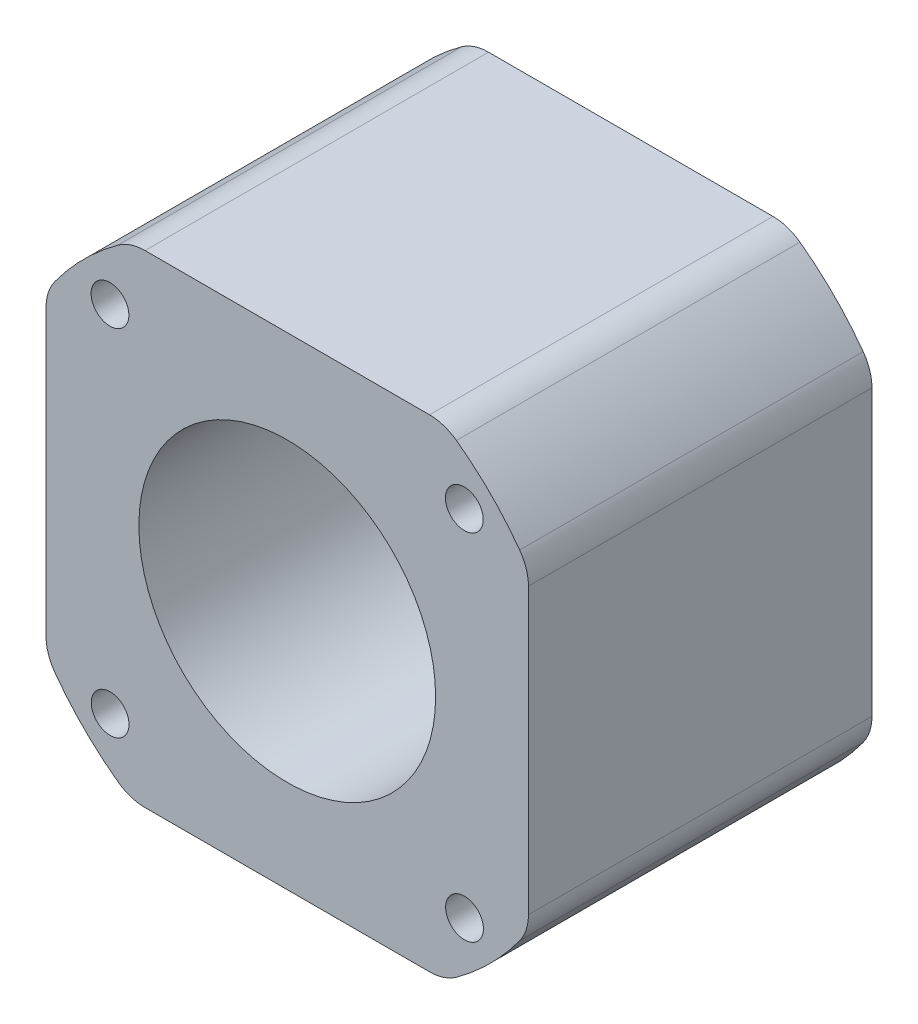
ISO-10303-21;
HEADER;
FILE_DESCRIPTION(('STEP AP214'),'2;1');
FILE_NAME('part.step','',(''),(''),'','','');
FILE_SCHEMA(('AUTOMOTIVE_DESIGN { 1 0 10303 214 1 1 1 1 }'));
ENDSEC;
DATA;
#1=APPLICATION_CONTEXT('core data for automotive mechanical design processes');
#2=APPLICATION_PROTOCOL_DEFINITION('international standard','automotive_design',2000,#1);
#3=PRODUCT_CONTEXT('',#1,'mechanical');
#4=PRODUCT('Part','Part','',(#3));
#5=PRODUCT_RELATED_PRODUCT_CATEGORY('part','',(#4));
#6=PRODUCT_DEFINITION_FORMATION('','',#4);
#7=PRODUCT_DEFINITION_CONTEXT('part definition',#1,'design');
#8=PRODUCT_DEFINITION('design','',#6,#7);
#9=PRODUCT_DEFINITION_SHAPE('','',#8);
#10=(LENGTH_UNIT() NAMED_UNIT(*) SI_UNIT(.MILLI.,.METRE.));
#11=(NAMED_UNIT(*) PLANE_ANGLE_UNIT() SI_UNIT($,.RADIAN.));
#12=(NAMED_UNIT(*) SI_UNIT($,.STERADIAN.) SOLID_ANGLE_UNIT());
#13=UNCERTAINTY_MEASURE_WITH_UNIT(LENGTH_MEASURE(1.E-05),#10,'distance_accuracy_value','');
#14=(GEOMETRIC_REPRESENTATION_CONTEXT(3) GLOBAL_UNCERTAINTY_ASSIGNED_CONTEXT((#13)) GLOBAL_UNIT_ASSIGNED_CONTEXT((#10,
#11,#12)) REPRESENTATION_CONTEXT('',''));
#15=CARTESIAN_POINT('',(0.,0.,0.));
#16=DIRECTION('',(0.,0.,1.));
#17=DIRECTION('',(1.,0.,0.));
#18=AXIS2_PLACEMENT_3D('',#15,#16,#17);
#19=CARTESIAN_POINT('',(-70.0852044065147,12.5160385326488,19.8188525116293));
#20=DIRECTION('',(0.,0.,1.));
#21=DIRECTION('',(1.,0.,0.));
#22=AXIS2_PLACEMENT_3D('',#19,#20,#21);
#23=CYLINDRICAL_SURFACE('',#22,1.65);
#24=CARTESIAN_POINT('',(-70.0852044065147,12.5160385326488,19.8188525116293));
#25=DIRECTION('',(0.,0.,-1.));
#26=DIRECTION('',(1.,0.,0.));
#27=AXIS2_PLACEMENT_3D('',#24,#25,#26);
#28=CIRCLE('',#27,1.65);
#29=CARTESIAN_POINT('',(-71.7352044065147,12.5160385326488,19.8188525116293));
#30=VERTEX_POINT('',#29);
#31=EDGE_CURVE('E11',#30,#30,#28,.T.);
#32=ORIENTED_EDGE('',*,*,#31,.T.);
#33=EDGE_LOOP('',(#32));
#34=FACE_BOUND('',#33,.T.);
#35=CARTESIAN_POINT('',(-70.0852044065147,12.5160385326488,49.8188525116293));
#36=DIRECTION('',(0.,0.,1.));
#37=DIRECTION('',(1.,0.,0.));
#38=AXIS2_PLACEMENT_3D('',#35,#36,#37);
#39=CIRCLE('',#38,1.65);
#40=CARTESIAN_POINT('',(-68.4352044065147,12.5160385326488,49.8188525116293));
#41=VERTEX_POINT('',#40);
#42=EDGE_CURVE('E27',#41,#41,#39,.T.);
#43=ORIENTED_EDGE('',*,*,#42,.T.);
#44=EDGE_LOOP('',(#43));
#45=FACE_BOUND('',#44,.T.);
#46=ADVANCED_FACE('F17',(#34,#45),#23,.F.);
#47=CARTESIAN_POINT('',(-54.6053184065147,-2.95027046735118,19.8188525116293));
#48=DIRECTION('',(0.,0.,1.));
#49=DIRECTION('',(1.,0.,0.));
#50=AXIS2_PLACEMENT_3D('',#47,#48,#49);
#51=CYLINDRICAL_SURFACE('',#50,12.9575);
#52=CARTESIAN_POINT('',(-54.6053184065147,-2.95027046735118,19.8188525116293));
#53=DIRECTION('',(0.,0.,-1.));
#54=DIRECTION('',(1.,0.,0.));
#55=AXIS2_PLACEMENT_3D('',#52,#53,#54);
#56=CIRCLE('',#55,12.9575);
#57=CARTESIAN_POINT('',(-67.5628184065147,-2.95027046735118,19.8188525116293));
#58=VERTEX_POINT('',#57);
#59=EDGE_CURVE('E202',#58,#58,#56,.T.);
#60=ORIENTED_EDGE('',*,*,#59,.T.);
#61=EDGE_LOOP('',(#60));
#62=FACE_BOUND('',#61,.T.);
#63=CARTESIAN_POINT('',(-54.6053184065147,-2.95027046735118,49.8188525116293));
#64=DIRECTION('',(0.,0.,-1.));
#65=DIRECTION('',(1.,0.,0.));
#66=AXIS2_PLACEMENT_3D('',#63,#64,#65);
#67=CIRCLE('',#66,12.9575);
#68=CARTESIAN_POINT('',(-41.6478184065147,-2.95027046735118,49.8188525116293));
#69=VERTEX_POINT('',#68);
#70=EDGE_CURVE('E166',#69,#69,#67,.T.);
#71=ORIENTED_EDGE('',*,*,#70,.F.);
#72=EDGE_LOOP('',(#71));
#73=FACE_BOUND('',#72,.T.);
#74=ADVANCED_FACE('F718',(#62,#73),#51,.F.);
#75=CARTESIAN_POINT('',(-39.1254324065147,-18.4165794673512,19.8188525116293));
#76=DIRECTION('',(0.,0.,1.));
#77=DIRECTION('',(1.,0.,0.));
#78=AXIS2_PLACEMENT_3D('',#75,#76,#77);
#79=CYLINDRICAL_SURFACE('',#78,1.65);
#80=CARTESIAN_POINT('',(-39.1254324065147,-18.4165794673512,19.8188525116293));
#81=DIRECTION('',(0.,0.,-1.));
#82=DIRECTION('',(1.,0.,0.));
#83=AXIS2_PLACEMENT_3D('',#80,#81,#82);
#84=CIRCLE('',#83,1.65);
#85=CARTESIAN_POINT('',(-40.7754324065147,-18.4165794673512,19.8188525116293));
#86=VERTEX_POINT('',#85);
#87=EDGE_CURVE('E205',#86,#86,#84,.T.);
#88=ORIENTED_EDGE('',*,*,#87,.T.);
#89=EDGE_LOOP('',(#88));
#90=FACE_BOUND('',#89,.T.);
#91=CARTESIAN_POINT('',(-39.1254324065147,-18.4165794673512,49.8188525116293));
#92=DIRECTION('',(0.,0.,-1.));
#93=DIRECTION('',(1.,0.,0.));
#94=AXIS2_PLACEMENT_3D('',#91,#92,#93);
#95=CIRCLE('',#94,1.65);
#96=CARTESIAN_POINT('',(-37.4754324065147,-18.4165794673512,49.8188525116293));
#97=VERTEX_POINT('',#96);
#98=EDGE_CURVE('E157',#97,#97,#95,.T.);
#99=ORIENTED_EDGE('',*,*,#98,.F.);
#100=EDGE_LOOP('',(#99));
#101=FACE_BOUND('',#100,.T.);
#102=ADVANCED_FACE('F722',(#90,#101),#79,.F.);
#103=CARTESIAN_POINT('',(-70.0716274065147,-18.4301564673512,19.8188525116293));
#104=DIRECTION('',(0.,0.,1.));
#105=DIRECTION('',(1.,0.,0.));
#106=AXIS2_PLACEMENT_3D('',#103,#104,#105);
#107=CYLINDRICAL_SURFACE('',#106,1.65);
#108=CARTESIAN_POINT('',(-70.0716274065147,-18.4301564673512,19.8188525116293));
#109=DIRECTION('',(0.,0.,-1.));
#110=DIRECTION('',(1.,0.,0.));
#111=AXIS2_PLACEMENT_3D('',#108,#109,#110);
#112=CIRCLE('',#111,1.65);
#113=CARTESIAN_POINT('',(-71.7216274065147,-18.4301564673512,19.8188525116293));
#114=VERTEX_POINT('',#113);
#115=EDGE_CURVE('E213',#114,#114,#112,.T.);
#116=ORIENTED_EDGE('',*,*,#115,.T.);
#117=EDGE_LOOP('',(#116));
#118=FACE_BOUND('',#117,.T.);
#119=CARTESIAN_POINT('',(-70.0716274065147,-18.4301564673512,49.8188525116293));
#120=DIRECTION('',(0.,0.,-1.));
#121=DIRECTION('',(1.,0.,0.));
#122=AXIS2_PLACEMENT_3D('',#119,#120,#121);
#123=CIRCLE('',#122,1.65);
#124=CARTESIAN_POINT('',(-68.4216274065147,-18.4301564673512,49.8188525116293));
#125=VERTEX_POINT('',#124);
#126=EDGE_CURVE('E153',#125,#125,#123,.T.);
#127=ORIENTED_EDGE('',*,*,#126,.F.);
#128=EDGE_LOOP('',(#127));
#129=FACE_BOUND('',#128,.T.);
#130=ADVANCED_FACE('F154',(#118,#129),#107,.F.);
#131=CARTESIAN_POINT('',(-39.1390094065147,12.5296155326488,19.8188525116293));
#132=DIRECTION('',(0.,0.,1.));
#133=DIRECTION('',(1.,0.,0.));
#134=AXIS2_PLACEMENT_3D('',#131,#132,#133);
#135=CYLINDRICAL_SURFACE('',#134,1.65);
#136=CARTESIAN_POINT('',(-39.1390094065147,12.5296155326488,19.8188525116293));
#137=DIRECTION('',(0.,0.,-1.));
#138=DIRECTION('',(1.,0.,0.));
#139=AXIS2_PLACEMENT_3D('',#136,#137,#138);
#140=CIRCLE('',#139,1.65);
#141=CARTESIAN_POINT('',(-40.7890094065147,12.5296155326488,19.8188525116293));
#142=VERTEX_POINT('',#141);
#143=EDGE_CURVE('E221',#142,#142,#140,.T.);
#144=ORIENTED_EDGE('',*,*,#143,.T.);
#145=EDGE_LOOP('',(#144));
#146=FACE_BOUND('',#145,.T.);
#147=CARTESIAN_POINT('',(-39.1390094065147,12.5296155326488,49.8188525116293));
#148=DIRECTION('',(0.,0.,-1.));
#149=DIRECTION('',(1.,0.,0.));
#150=AXIS2_PLACEMENT_3D('',#147,#148,#149);
#151=CIRCLE('',#150,1.65);
#152=CARTESIAN_POINT('',(-37.4890094065147,12.5296155326488,49.8188525116293));
#153=VERTEX_POINT('',#152);
#154=EDGE_CURVE('E158',#153,#153,#151,.T.);
#155=ORIENTED_EDGE('',*,*,#154,.F.);
#156=EDGE_LOOP('',(#155));
#157=FACE_BOUND('',#156,.T.);
#158=ADVANCED_FACE('F699',(#146,#157),#135,.F.);
#159=CARTESIAN_POINT('',(-67.0275698635147,14.1147295326488,49.8188525116293));
#160=DIRECTION('',(0.,0.,-1.));
#161=DIRECTION('',(0.,1.,0.));
#162=AXIS2_PLACEMENT_3D('',#159,#160,#161);
#163=CYLINDRICAL_SURFACE('',#162,4.);
#164=DIRECTION('',(0.,0.,1.));
#165=VECTOR('',#164,1.);
#166=CARTESIAN_POINT('',(-69.3816622952109,17.3486511181171,34.8188525116293));
#167=LINE('',#166,#165);
#168=CARTESIAN_POINT('',(-69.3816622909978,17.348651121184,19.8188525116293));
#169=VERTEX_POINT('',#168);
#170=CARTESIAN_POINT('',(-69.381662291074,17.3486511212887,49.8188525116293));
#171=VERTEX_POINT('',#170);
#172=EDGE_CURVE('E262',#169,#171,#167,.T.);
#173=ORIENTED_EDGE('',*,*,#172,.T.);
#174=CARTESIAN_POINT('',(-67.0275698635147,14.1147295326488,49.8188525116293));
#175=DIRECTION('',(0.,0.,1.));
#176=DIRECTION('',(0.,1.,0.));
#177=AXIS2_PLACEMENT_3D('',#174,#175,#176);
#178=CIRCLE('',#177,4.);
#179=CARTESIAN_POINT('',(-67.0275698635147,18.1147295326488,49.8188525116293));
#180=VERTEX_POINT('',#179);
#181=EDGE_CURVE('E284',#180,#171,#178,.T.);
#182=ORIENTED_EDGE('',*,*,#181,.F.);
#183=DIRECTION('',(0.,0.,-1.));
#184=VECTOR('',#183,1.);
#185=CARTESIAN_POINT('',(-67.0275698635147,18.1147295326488,34.8188525116293));
#186=LINE('',#185,#184);
#187=CARTESIAN_POINT('',(-67.0275698635147,18.1147295326488,19.8188525116293));
#188=VERTEX_POINT('',#187);
#189=EDGE_CURVE('E258',#180,#188,#186,.T.);
#190=ORIENTED_EDGE('',*,*,#189,.T.);
#191=CARTESIAN_POINT('',(-67.0275698635147,14.1147295326488,19.8188525116293));
#192=DIRECTION('',(0.,0.,1.));
#193=DIRECTION('',(0.,1.,0.));
#194=AXIS2_PLACEMENT_3D('',#191,#192,#193);
#195=CIRCLE('',#194,4.);
#196=EDGE_CURVE('E196',#188,#169,#195,.T.);
#197=ORIENTED_EDGE('',*,*,#196,.T.);
#198=EDGE_LOOP('',(#173,#182,#190,#197));
#199=FACE_BOUND('',#198,.T.);
#200=ADVANCED_FACE('F693',(#199),#163,.T.);
#201=CARTESIAN_POINT('',(-54.6053184065147,-2.95027046735118,49.8188525116293));
#202=DIRECTION('',(0.,0.,-1.));
#203=DIRECTION('',(0.,1.,0.));
#204=AXIS2_PLACEMENT_3D('',#201,#202,#203);
#205=CYLINDRICAL_SURFACE('',#204,25.1075);
#206=DIRECTION('',(0.,0.,1.));
#207=VECTOR('',#206,1.);
#208=CARTESIAN_POINT('',(-74.9042399992203,11.8260734118431,34.8188525116293));
#209=LINE('',#208,#207);
#210=CARTESIAN_POINT('',(-74.9042399987733,11.8260734124572,19.8188525116293));
#211=VERTEX_POINT('',#210);
#212=CARTESIAN_POINT('',(-74.9042399986686,11.8260734123809,49.8188525116293));
#213=VERTEX_POINT('',#212);
#214=EDGE_CURVE('E192',#211,#213,#209,.T.);
#215=ORIENTED_EDGE('',*,*,#214,.T.);
#216=CARTESIAN_POINT('',(-54.6053184065147,-2.95027046735118,49.8188525116293));
#217=DIRECTION('',(0.,0.,1.));
#218=DIRECTION('',(0.,1.,0.));
#219=AXIS2_PLACEMENT_3D('',#216,#217,#218);
#220=CIRCLE('',#219,25.1075);
#221=EDGE_CURVE('E337',#171,#213,#220,.T.);
#222=ORIENTED_EDGE('',*,*,#221,.F.);
#223=ORIENTED_EDGE('',*,*,#172,.F.);
#224=CARTESIAN_POINT('',(-54.6053184065147,-2.95027046735119,19.8188525116293));
#225=DIRECTION('',(0.,0.,1.));
#226=DIRECTION('',(0.,1.,0.));
#227=AXIS2_PLACEMENT_3D('',#224,#225,#226);
#228=CIRCLE('',#227,25.1075);
#229=EDGE_CURVE('E197',#169,#211,#228,.T.);
#230=ORIENTED_EDGE('',*,*,#229,.T.);
#231=EDGE_LOOP('',(#215,#222,#223,#230));
#232=FACE_BOUND('',#231,.T.);
#233=ADVANCED_FACE('F698',(#232),#205,.T.);
#234=CARTESIAN_POINT('',(-71.6703184065147,9.47198098964882,49.8188525116293));
#235=DIRECTION('',(0.,0.,-1.));
#236=DIRECTION('',(0.,1.,0.));
#237=AXIS2_PLACEMENT_3D('',#234,#235,#236);
#238=CYLINDRICAL_SURFACE('',#237,4.);
#239=DIRECTION('',(0.,0.,1.));
#240=VECTOR('',#239,1.);
#241=CARTESIAN_POINT('',(-75.6703184065147,9.47198098964882,34.8188525116293));
#242=LINE('',#241,#240);
#243=CARTESIAN_POINT('',(-75.6703184065147,9.47198098964882,19.8188525116293));
#244=VERTEX_POINT('',#243);
#245=CARTESIAN_POINT('',(-75.6703184065147,9.47198098964882,49.8188525116293));
#246=VERTEX_POINT('',#245);
#247=EDGE_CURVE('E200',#244,#246,#242,.T.);
#248=ORIENTED_EDGE('',*,*,#247,.T.);
#249=CARTESIAN_POINT('',(-71.6703184065147,9.47198098964882,49.8188525116293));
#250=DIRECTION('',(0.,0.,1.));
#251=DIRECTION('',(0.,1.,0.));
#252=AXIS2_PLACEMENT_3D('',#249,#250,#251);
#253=CIRCLE('',#252,4.);
#254=EDGE_CURVE('E292',#213,#246,#253,.T.);
#255=ORIENTED_EDGE('',*,*,#254,.F.);
#256=ORIENTED_EDGE('',*,*,#214,.F.);
#257=CARTESIAN_POINT('',(-71.6703184065147,9.47198098964881,19.8188525116293));
#258=DIRECTION('',(0.,0.,1.));
#259=DIRECTION('',(0.,1.,0.));
#260=AXIS2_PLACEMENT_3D('',#257,#258,#259);
#261=CIRCLE('',#260,4.);
#262=EDGE_CURVE('E198',#211,#244,#261,.T.);
#263=ORIENTED_EDGE('',*,*,#262,.T.);
#264=EDGE_LOOP('',(#248,#255,#256,#263));
#265=FACE_BOUND('',#264,.T.);
#266=ADVANCED_FACE('F730',(#265),#238,.T.);
#267=CARTESIAN_POINT('',(-75.6703184065147,-15.3725219243512,49.8188525116293));
#268=DIRECTION('',(1.,0.,0.));
#269=DIRECTION('',(0.,1.,0.));
#270=AXIS2_PLACEMENT_3D('',#267,#268,#269);
#271=PLANE('',#270);
#272=DIRECTION('',(0.,0.,1.));
#273=VECTOR('',#272,1.);
#274=CARTESIAN_POINT('',(-75.6703184065147,-15.3725219250696,34.8188525116293));
#275=LINE('',#274,#273);
#276=CARTESIAN_POINT('',(-75.6703184065147,-15.3725219247103,19.8188525116293));
#277=VERTEX_POINT('',#276);
#278=CARTESIAN_POINT('',(-75.6703184065147,-15.3725219247103,49.8188525116293));
#279=VERTEX_POINT('',#278);
#280=EDGE_CURVE('E201',#277,#279,#275,.T.);
#281=ORIENTED_EDGE('',*,*,#280,.T.);
#282=DIRECTION('',(0.,-1.,0.));
#283=VECTOR('',#282,1.);
#284=CARTESIAN_POINT('',(-75.6703184065147,-2.95027046735118,49.8188525116293));
#285=LINE('',#284,#283);
#286=EDGE_CURVE('E288',#246,#279,#285,.T.);
#287=ORIENTED_EDGE('',*,*,#286,.F.);
#288=ORIENTED_EDGE('',*,*,#247,.F.);
#289=DIRECTION('',(0.,-1.,0.));
#290=VECTOR('',#289,1.);
#291=CARTESIAN_POINT('',(-75.6703184065147,-2.95027046735118,19.8188525116293));
#292=LINE('',#291,#290);
#293=EDGE_CURVE('E249',#244,#277,#292,.T.);
#294=ORIENTED_EDGE('',*,*,#293,.T.);
#295=EDGE_LOOP('',(#281,#287,#288,#294));
#296=FACE_BOUND('',#295,.T.);
#297=ADVANCED_FACE('F734',(#296),#271,.F.);
#298=CARTESIAN_POINT('',(-71.6703184065147,-15.3725219243512,49.8188525116293));
#299=DIRECTION('',(0.,0.,-1.));
#300=DIRECTION('',(0.,1.,0.));
#301=AXIS2_PLACEMENT_3D('',#298,#299,#300);
#302=CYLINDRICAL_SURFACE('',#301,4.);
#303=DIRECTION('',(0.,0.,1.));
#304=VECTOR('',#303,1.);
#305=CARTESIAN_POINT('',(-74.9042400010751,-17.7266143435572,34.8188525116293));
#306=LINE('',#305,#304);
#307=CARTESIAN_POINT('',(-74.9042399995959,-17.7266143455892,19.8188525116293));
#308=VERTEX_POINT('',#307);
#309=CARTESIAN_POINT('',(-74.9042399997007,-17.7266143456654,49.8188525116293));
#310=VERTEX_POINT('',#309);
#311=EDGE_CURVE('E277',#308,#310,#306,.T.);
#312=ORIENTED_EDGE('',*,*,#311,.T.);
#313=CARTESIAN_POINT('',(-71.6703184065147,-15.3725219243512,49.8188525116293));
#314=DIRECTION('',(0.,0.,1.));
#315=DIRECTION('',(0.,1.,0.));
#316=AXIS2_PLACEMENT_3D('',#313,#314,#315);
#317=CIRCLE('',#316,4.);
#318=EDGE_CURVE('E293',#279,#310,#317,.T.);
#319=ORIENTED_EDGE('',*,*,#318,.F.);
#320=ORIENTED_EDGE('',*,*,#280,.F.);
#321=CARTESIAN_POINT('',(-71.6703184065147,-15.3725219243512,19.8188525116293));
#322=DIRECTION('',(0.,0.,1.));
#323=DIRECTION('',(0.,1.,0.));
#324=AXIS2_PLACEMENT_3D('',#321,#322,#323);
#325=CIRCLE('',#324,4.);
#326=EDGE_CURVE('E191',#277,#308,#325,.T.);
#327=ORIENTED_EDGE('',*,*,#326,.T.);
#328=EDGE_LOOP('',(#312,#319,#320,#327));
#329=FACE_BOUND('',#328,.T.);
#330=ADVANCED_FACE('F811',(#329),#302,.T.);
#331=CARTESIAN_POINT('',(-54.6053184065147,-2.95027046735118,49.8188525116293));
#332=DIRECTION('',(0.,0.,-1.));
#333=DIRECTION('',(0.,1.,0.));
#334=AXIS2_PLACEMENT_3D('',#331,#332,#333);
#335=CYLINDRICAL_SURFACE('',#334,25.1075);
#336=DIRECTION('',(0.,0.,1.));
#337=VECTOR('',#336,1.);
#338=CARTESIAN_POINT('',(-69.3816622876989,-23.2491920586083,34.8188525116293));
#339=LINE('',#338,#337);
#340=CARTESIAN_POINT('',(-69.381662287318,-23.2491920588855,19.8188525116293));
#341=VERTEX_POINT('',#340);
#342=CARTESIAN_POINT('',(-69.3816622872418,-23.2491920587807,49.8188525116293));
#343=VERTEX_POINT('',#342);
#344=EDGE_CURVE('E177',#341,#343,#339,.T.);
#345=ORIENTED_EDGE('',*,*,#344,.T.);
#346=CARTESIAN_POINT('',(-54.6053184065147,-2.95027046735118,49.8188525116293));
#347=DIRECTION('',(0.,0.,1.));
#348=DIRECTION('',(0.,1.,0.));
#349=AXIS2_PLACEMENT_3D('',#346,#347,#348);
#350=CIRCLE('',#349,25.1075);
#351=EDGE_CURVE('E318',#310,#343,#350,.T.);
#352=ORIENTED_EDGE('',*,*,#351,.F.);
#353=ORIENTED_EDGE('',*,*,#311,.F.);
#354=CARTESIAN_POINT('',(-54.6053184065147,-2.95027046735119,19.8188525116293));
#355=DIRECTION('',(0.,0.,1.));
#356=DIRECTION('',(0.,1.,0.));
#357=AXIS2_PLACEMENT_3D('',#354,#355,#356);
#358=CIRCLE('',#357,25.1075);
#359=EDGE_CURVE('E173',#308,#341,#358,.T.);
#360=ORIENTED_EDGE('',*,*,#359,.T.);
#361=EDGE_LOOP('',(#345,#352,#353,#360));
#362=FACE_BOUND('',#361,.T.);
#363=ADVANCED_FACE('F438',(#362),#335,.T.);
#364=CARTESIAN_POINT('',(-67.0275698635147,-20.0152704673512,49.8188525116293));
#365=DIRECTION('',(0.,0.,-1.));
#366=DIRECTION('',(0.,1.,0.));
#367=AXIS2_PLACEMENT_3D('',#364,#365,#366);
#368=CYLINDRICAL_SURFACE('',#367,4.);
#369=DIRECTION('',(0.,0.,1.));
#370=VECTOR('',#369,1.);
#371=CARTESIAN_POINT('',(-67.0275698635147,-24.0152704673512,34.8188525116293));
#372=LINE('',#371,#370);
#373=CARTESIAN_POINT('',(-67.0275698635147,-24.0152704673512,19.8188525116293));
#374=VERTEX_POINT('',#373);
#375=CARTESIAN_POINT('',(-67.0275698635147,-24.0152704673512,49.8188525116293));
#376=VERTEX_POINT('',#375);
#377=EDGE_CURVE('E178',#374,#376,#372,.T.);
#378=ORIENTED_EDGE('',*,*,#377,.T.);
#379=CARTESIAN_POINT('',(-67.0275698635147,-20.0152704673512,49.8188525116293));
#380=DIRECTION('',(0.,0.,1.));
#381=DIRECTION('',(0.,1.,0.));
#382=AXIS2_PLACEMENT_3D('',#379,#380,#381);
#383=CIRCLE('',#382,4.);
#384=EDGE_CURVE('E20',#343,#376,#383,.T.);
#385=ORIENTED_EDGE('',*,*,#384,.F.);
#386=ORIENTED_EDGE('',*,*,#344,.F.);
#387=CARTESIAN_POINT('',(-67.0275698635147,-20.0152704673512,19.8188525116293));
#388=DIRECTION('',(0.,0.,1.));
#389=DIRECTION('',(0.,1.,0.));
#390=AXIS2_PLACEMENT_3D('',#387,#388,#389);
#391=CIRCLE('',#390,4.);
#392=EDGE_CURVE('E315',#341,#374,#391,.T.);
#393=ORIENTED_EDGE('',*,*,#392,.T.);
#394=EDGE_LOOP('',(#378,#385,#386,#393));
#395=FACE_BOUND('',#394,.T.);
#396=ADVANCED_FACE('F443',(#395),#368,.T.);
#397=CARTESIAN_POINT('',(-67.0275698635147,-24.0152704673512,19.8188525116293));
#398=DIRECTION('',(0.,1.,0.));
#399=DIRECTION('',(1.,0.,0.));
#400=AXIS2_PLACEMENT_3D('',#397,#398,#399);
#401=PLANE('',#400);
#402=DIRECTION('',(0.,0.,1.));
#403=VECTOR('',#402,1.);
#404=CARTESIAN_POINT('',(-42.183066947976,-24.0152704673512,34.8188525116293));
#405=LINE('',#404,#403);
#406=CARTESIAN_POINT('',(-42.1830669487453,-24.0152704673512,19.8188525116293));
#407=VERTEX_POINT('',#406);
#408=CARTESIAN_POINT('',(-42.1830669487453,-24.0152704673512,49.8188525116293));
#409=VERTEX_POINT('',#408);
#410=EDGE_CURVE('E298',#407,#409,#405,.T.);
#411=ORIENTED_EDGE('',*,*,#410,.T.);
#412=DIRECTION('',(1.,0.,0.));
#413=VECTOR('',#412,1.);
#414=CARTESIAN_POINT('',(-54.6053184065147,-24.0152704673512,49.8188525116293));
#415=LINE('',#414,#413);
#416=EDGE_CURVE('E254',#376,#409,#415,.T.);
#417=ORIENTED_EDGE('',*,*,#416,.F.);
#418=ORIENTED_EDGE('',*,*,#377,.F.);
#419=DIRECTION('',(1.,0.,0.));
#420=VECTOR('',#419,1.);
#421=CARTESIAN_POINT('',(-54.6053184065147,-24.0152704673512,19.8188525116293));
#422=LINE('',#421,#420);
#423=EDGE_CURVE('E294',#374,#407,#422,.T.);
#424=ORIENTED_EDGE('',*,*,#423,.T.);
#425=EDGE_LOOP('',(#411,#417,#418,#424));
#426=FACE_BOUND('',#425,.T.);
#427=ADVANCED_FACE('F449',(#426),#401,.F.);
#428=CARTESIAN_POINT('',(-42.1830669495147,-20.0152704673512,49.8188525116293));
#429=DIRECTION('',(0.,0.,-1.));
#430=DIRECTION('',(0.,1.,0.));
#431=AXIS2_PLACEMENT_3D('',#428,#429,#430);
#432=CYLINDRICAL_SURFACE('',#431,4.);
#433=DIRECTION('',(0.,0.,1.));
#434=VECTOR('',#433,1.);
#435=CARTESIAN_POINT('',(-39.8289745261454,-23.2491920588809,34.8188525116293));
#436=LINE('',#435,#434);
#437=CARTESIAN_POINT('',(-39.8289745261951,-23.249192058917,19.8188525116293));
#438=VERTEX_POINT('',#437);
#439=CARTESIAN_POINT('',(-39.8289745261188,-23.2491920590218,49.8188525116293));
#440=VERTEX_POINT('',#439);
#441=EDGE_CURVE('E299',#438,#440,#436,.T.);
#442=ORIENTED_EDGE('',*,*,#441,.T.);
#443=CARTESIAN_POINT('',(-42.1830669495147,-20.0152704673512,49.8188525116293));
#444=DIRECTION('',(0.,0.,1.));
#445=DIRECTION('',(0.,1.,0.));
#446=AXIS2_PLACEMENT_3D('',#443,#444,#445);
#447=CIRCLE('',#446,4.);
#448=EDGE_CURVE('E182',#409,#440,#447,.T.);
#449=ORIENTED_EDGE('',*,*,#448,.F.);
#450=ORIENTED_EDGE('',*,*,#410,.F.);
#451=CARTESIAN_POINT('',(-42.1830669495147,-20.0152704673512,19.8188525116293));
#452=DIRECTION('',(0.,0.,1.));
#453=DIRECTION('',(0.,1.,0.));
#454=AXIS2_PLACEMENT_3D('',#451,#452,#453);
#455=CIRCLE('',#454,4.);
#456=EDGE_CURVE('E300',#407,#438,#455,.T.);
#457=ORIENTED_EDGE('',*,*,#456,.T.);
#458=EDGE_LOOP('',(#442,#449,#450,#457));
#459=FACE_BOUND('',#458,.T.);
#460=ADVANCED_FACE('F451',(#459),#432,.T.);
#461=CARTESIAN_POINT('',(-54.6053184065147,-2.95027046735118,49.8188525116293));
#462=DIRECTION('',(0.,0.,-1.));
#463=DIRECTION('',(0.,1.,0.));
#464=AXIS2_PLACEMENT_3D('',#461,#462,#463);
#465=CYLINDRICAL_SURFACE('',#464,25.1075);
#466=DIRECTION('',(0.,0.,1.));
#467=VECTOR('',#466,1.);
#468=CARTESIAN_POINT('',(-34.3063968147748,-17.726614347872,34.8188525116293));
#469=LINE('',#468,#467);
#470=CARTESIAN_POINT('',(-34.306396814739,-17.7266143478228,19.8188525116293));
#471=VERTEX_POINT('',#470);
#472=CARTESIAN_POINT('',(-34.3063968148438,-17.7266143477466,49.8188525116293));
#473=VERTEX_POINT('',#472);
#474=EDGE_CURVE('E304',#471,#473,#469,.T.);
#475=ORIENTED_EDGE('',*,*,#474,.T.);
#476=CARTESIAN_POINT('',(-54.6053184065147,-2.95027046735118,49.8188525116293));
#477=DIRECTION('',(0.,0.,1.));
#478=DIRECTION('',(0.,1.,0.));
#479=AXIS2_PLACEMENT_3D('',#476,#477,#478);
#480=CIRCLE('',#479,25.1075);
#481=EDGE_CURVE('E179',#440,#473,#480,.T.);
#482=ORIENTED_EDGE('',*,*,#481,.F.);
#483=ORIENTED_EDGE('',*,*,#441,.F.);
#484=CARTESIAN_POINT('',(-54.6053184065147,-2.95027046735119,19.8188525116293));
#485=DIRECTION('',(0.,0.,1.));
#486=DIRECTION('',(0.,1.,0.));
#487=AXIS2_PLACEMENT_3D('',#484,#485,#486);
#488=CIRCLE('',#487,25.1075);
#489=EDGE_CURVE('E236',#438,#471,#488,.T.);
#490=ORIENTED_EDGE('',*,*,#489,.T.);
#491=EDGE_LOOP('',(#475,#482,#483,#490));
#492=FACE_BOUND('',#491,.T.);
#493=ADVANCED_FACE('F787',(#492),#465,.T.);
#494=CARTESIAN_POINT('',(-37.5403184065147,-15.3725219243512,49.8188525116293));
#495=DIRECTION('',(0.,0.,-1.));
#496=DIRECTION('',(0.,1.,0.));
#497=AXIS2_PLACEMENT_3D('',#494,#495,#496);
#498=CYLINDRICAL_SURFACE('',#497,4.);
#499=DIRECTION('',(0.,0.,1.));
#500=VECTOR('',#499,1.);
#501=CARTESIAN_POINT('',(-33.5403184065147,-15.3725219243512,34.8188525116293));
#502=LINE('',#501,#500);
#503=CARTESIAN_POINT('',(-33.5403184065147,-15.3725219243512,19.8188525116293));
#504=VERTEX_POINT('',#503);
#505=CARTESIAN_POINT('',(-33.5403184065147,-15.3725219243512,49.8188525116293));
#506=VERTEX_POINT('',#505);
#507=EDGE_CURVE('E232',#504,#506,#502,.T.);
#508=ORIENTED_EDGE('',*,*,#507,.T.);
#509=CARTESIAN_POINT('',(-37.5403184065147,-15.3725219243512,49.8188525116293));
#510=DIRECTION('',(0.,0.,1.));
#511=DIRECTION('',(0.,1.,0.));
#512=AXIS2_PLACEMENT_3D('',#509,#510,#511);
#513=CIRCLE('',#512,4.);
#514=EDGE_CURVE('E183',#473,#506,#513,.T.);
#515=ORIENTED_EDGE('',*,*,#514,.F.);
#516=ORIENTED_EDGE('',*,*,#474,.F.);
#517=CARTESIAN_POINT('',(-37.5403184065147,-15.3725219243512,19.8188525116293));
#518=DIRECTION('',(0.,0.,1.));
#519=DIRECTION('',(0.,1.,0.));
#520=AXIS2_PLACEMENT_3D('',#517,#518,#519);
#521=CIRCLE('',#520,4.);
#522=EDGE_CURVE('E237',#471,#504,#521,.T.);
#523=ORIENTED_EDGE('',*,*,#522,.T.);
#524=EDGE_LOOP('',(#508,#515,#516,#523));
#525=FACE_BOUND('',#524,.T.);
#526=ADVANCED_FACE('F851',(#525),#498,.T.);
#527=CARTESIAN_POINT('',(-33.5403184065147,-15.3725219243512,19.8188525116293));
#528=DIRECTION('',(-1.,0.,0.));
#529=DIRECTION('',(0.,0.,1.));
#530=AXIS2_PLACEMENT_3D('',#527,#528,#529);
#531=PLANE('',#530);
#532=DIRECTION('',(0.,0.,1.));
#533=VECTOR('',#532,1.);
#534=CARTESIAN_POINT('',(-33.5403184065147,9.47198098800799,34.8188525116293));
#535=LINE('',#534,#533);
#536=CARTESIAN_POINT('',(-33.5403184065147,9.4719809888284,19.8188525116293));
#537=VERTEX_POINT('',#536);
#538=CARTESIAN_POINT('',(-33.5403184065147,9.47198098882841,49.8188525116293));
#539=VERTEX_POINT('',#538);
#540=EDGE_CURVE('E253',#537,#539,#535,.T.);
#541=ORIENTED_EDGE('',*,*,#540,.T.);
#542=DIRECTION('',(0.,1.,0.));
#543=VECTOR('',#542,1.);
#544=CARTESIAN_POINT('',(-33.5403184065147,-2.95027046735118,49.8188525116293));
#545=LINE('',#544,#543);
#546=EDGE_CURVE('E325',#506,#539,#545,.T.);
#547=ORIENTED_EDGE('',*,*,#546,.F.);
#548=ORIENTED_EDGE('',*,*,#507,.F.);
#549=DIRECTION('',(0.,1.,0.));
#550=VECTOR('',#549,1.);
#551=CARTESIAN_POINT('',(-33.5403184065147,-2.95027046735118,19.8188525116293));
#552=LINE('',#551,#550);
#553=EDGE_CURVE('E231',#504,#537,#552,.T.);
#554=ORIENTED_EDGE('',*,*,#553,.T.);
#555=EDGE_LOOP('',(#541,#547,#548,#554));
#556=FACE_BOUND('',#555,.T.);
#557=ADVANCED_FACE('F799',(#556),#531,.F.);
#558=CARTESIAN_POINT('',(-37.5403184065147,9.47198098964882,49.8188525116293));
#559=DIRECTION('',(0.,0.,-1.));
#560=DIRECTION('',(0.,1.,0.));
#561=AXIS2_PLACEMENT_3D('',#558,#559,#560);
#562=CYLINDRICAL_SURFACE('',#561,4.);
#563=DIRECTION('',(0.,0.,1.));
#564=VECTOR('',#563,1.);
#565=CARTESIAN_POINT('',(-34.3063968180157,11.8260734171816,34.8188525116293));
#566=LINE('',#565,#564);
#567=CARTESIAN_POINT('',(-34.3063968164642,11.8260734150502,19.8188525116293));
#568=VERTEX_POINT('',#567);
#569=CARTESIAN_POINT('',(-34.3063968163594,11.8260734151264,49.8188525116293));
#570=VERTEX_POINT('',#569);
#571=EDGE_CURVE('E227',#568,#570,#566,.T.);
#572=ORIENTED_EDGE('',*,*,#571,.T.);
#573=CARTESIAN_POINT('',(-37.5403184065147,9.47198098964882,49.8188525116293));
#574=DIRECTION('',(0.,0.,1.));
#575=DIRECTION('',(0.,1.,0.));
#576=AXIS2_PLACEMENT_3D('',#573,#574,#575);
#577=CIRCLE('',#576,4.);
#578=EDGE_CURVE('E328',#539,#570,#577,.T.);
#579=ORIENTED_EDGE('',*,*,#578,.F.);
#580=ORIENTED_EDGE('',*,*,#540,.F.);
#581=CARTESIAN_POINT('',(-37.5403184065147,9.47198098964881,19.8188525116293));
#582=DIRECTION('',(0.,0.,1.));
#583=DIRECTION('',(0.,1.,0.));
#584=AXIS2_PLACEMENT_3D('',#581,#582,#583);
#585=CIRCLE('',#584,4.);
#586=EDGE_CURVE('E225',#537,#568,#585,.T.);
#587=ORIENTED_EDGE('',*,*,#586,.T.);
#588=EDGE_LOOP('',(#572,#579,#580,#587));
#589=FACE_BOUND('',#588,.T.);
#590=ADVANCED_FACE('F795',(#589),#562,.T.);
#591=CARTESIAN_POINT('',(-54.6053184065147,-2.95027046735118,49.8188525116293));
#592=DIRECTION('',(0.,0.,-1.));
#593=DIRECTION('',(0.,1.,0.));
#594=AXIS2_PLACEMENT_3D('',#591,#592,#593);
#595=CYLINDRICAL_SURFACE('',#594,25.1075);
#596=DIRECTION('',(0.,0.,1.));
#597=VECTOR('',#596,1.);
#598=CARTESIAN_POINT('',(-39.8289745266571,17.3486511248716,34.8188525116293));
#599=LINE('',#598,#597);
#600=CARTESIAN_POINT('',(-39.8289745263747,17.348651124666,19.8188525116293));
#601=VERTEX_POINT('',#600);
#602=CARTESIAN_POINT('',(-39.828974526451,17.3486511245613,49.8188525116293));
#603=VERTEX_POINT('',#602);
#604=EDGE_CURVE('E240',#601,#603,#599,.T.);
#605=ORIENTED_EDGE('',*,*,#604,.T.);
#606=CARTESIAN_POINT('',(-54.6053184065147,-2.95027046735118,49.8188525116293));
#607=DIRECTION('',(0.,0.,1.));
#608=DIRECTION('',(0.,1.,0.));
#609=AXIS2_PLACEMENT_3D('',#606,#607,#608);
#610=CIRCLE('',#609,25.1075);
#611=EDGE_CURVE('E187',#570,#603,#610,.T.);
#612=ORIENTED_EDGE('',*,*,#611,.F.);
#613=ORIENTED_EDGE('',*,*,#571,.F.);
#614=CARTESIAN_POINT('',(-54.6053184065147,-2.95027046735119,19.8188525116293));
#615=DIRECTION('',(0.,0.,1.));
#616=DIRECTION('',(0.,1.,0.));
#617=AXIS2_PLACEMENT_3D('',#614,#615,#616);
#618=CIRCLE('',#617,25.1075);
#619=EDGE_CURVE('E238',#568,#601,#618,.T.);
#620=ORIENTED_EDGE('',*,*,#619,.T.);
#621=EDGE_LOOP('',(#605,#612,#613,#620));
#622=FACE_BOUND('',#621,.T.);
#623=ADVANCED_FACE('F389',(#622),#595,.T.);
#624=CARTESIAN_POINT('',(-42.1830669495147,14.1147295326488,49.8188525116293));
#625=DIRECTION('',(0.,0.,-1.));
#626=DIRECTION('',(0.,1.,0.));
#627=AXIS2_PLACEMENT_3D('',#624,#625,#626);
#628=CYLINDRICAL_SURFACE('',#627,4.);
#629=DIRECTION('',(0.,0.,1.));
#630=VECTOR('',#629,1.);
#631=CARTESIAN_POINT('',(-42.1830669495147,18.1147295326488,34.8188525116293));
#632=LINE('',#631,#630);
#633=CARTESIAN_POINT('',(-42.1830669495147,18.1147295326488,19.8188525116293));
#634=VERTEX_POINT('',#633);
#635=CARTESIAN_POINT('',(-42.1830669495147,18.1147295326488,49.8188525116293));
#636=VERTEX_POINT('',#635);
#637=EDGE_CURVE('E241',#634,#636,#632,.T.);
#638=ORIENTED_EDGE('',*,*,#637,.T.);
#639=CARTESIAN_POINT('',(-42.1830669495147,14.1147295326488,49.8188525116293));
#640=DIRECTION('',(0.,0.,1.));
#641=DIRECTION('',(0.,1.,0.));
#642=AXIS2_PLACEMENT_3D('',#639,#640,#641);
#643=CIRCLE('',#642,4.);
#644=EDGE_CURVE('E270',#603,#636,#643,.T.);
#645=ORIENTED_EDGE('',*,*,#644,.F.);
#646=ORIENTED_EDGE('',*,*,#604,.F.);
#647=CARTESIAN_POINT('',(-42.1830669495147,14.1147295326488,19.8188525116293));
#648=DIRECTION('',(0.,0.,1.));
#649=DIRECTION('',(0.,1.,0.));
#650=AXIS2_PLACEMENT_3D('',#647,#648,#649);
#651=CIRCLE('',#650,4.);
#652=EDGE_CURVE('E266',#601,#634,#651,.T.);
#653=ORIENTED_EDGE('',*,*,#652,.T.);
#654=EDGE_LOOP('',(#638,#645,#646,#653));
#655=FACE_BOUND('',#654,.T.);
#656=ADVANCED_FACE('F393',(#655),#628,.T.);
#657=CARTESIAN_POINT('',(-67.0275698635147,18.1147295326488,49.8188525116293));
#658=DIRECTION('',(0.,-1.,0.));
#659=DIRECTION('',(0.,0.,-1.));
#660=AXIS2_PLACEMENT_3D('',#657,#658,#659);
#661=PLANE('',#660);
#662=ORIENTED_EDGE('',*,*,#189,.F.);
#663=DIRECTION('',(-1.,0.,0.));
#664=VECTOR('',#663,1.);
#665=CARTESIAN_POINT('',(-54.6053184065147,18.1147295326488,49.8188525116293));
#666=LINE('',#665,#664);
#667=EDGE_CURVE('E274',#636,#180,#666,.T.);
#668=ORIENTED_EDGE('',*,*,#667,.F.);
#669=ORIENTED_EDGE('',*,*,#637,.F.);
#670=DIRECTION('',(-1.,0.,0.));
#671=VECTOR('',#670,1.);
#672=CARTESIAN_POINT('',(-54.6053184065147,18.1147295326488,19.8188525116293));
#673=LINE('',#672,#671);
#674=EDGE_CURVE('E269',#634,#188,#673,.T.);
#675=ORIENTED_EDGE('',*,*,#674,.T.);
#676=EDGE_LOOP('',(#662,#668,#669,#675));
#677=FACE_BOUND('',#676,.T.);
#678=ADVANCED_FACE('F403',(#677),#661,.F.);
#679=CARTESIAN_POINT('',(-75.6703184065147,-24.0152704673512,19.8188525116293));
#680=DIRECTION('',(0.,0.,1.));
#681=DIRECTION('',(1.,0.,0.));
#682=AXIS2_PLACEMENT_3D('',#679,#680,#681);
#683=PLANE('',#682);
#684=ORIENTED_EDGE('',*,*,#674,.F.);
#685=ORIENTED_EDGE('',*,*,#652,.F.);
#686=ORIENTED_EDGE('',*,*,#619,.F.);
#687=ORIENTED_EDGE('',*,*,#586,.F.);
#688=ORIENTED_EDGE('',*,*,#553,.F.);
#689=ORIENTED_EDGE('',*,*,#522,.F.);
#690=ORIENTED_EDGE('',*,*,#489,.F.);
#691=ORIENTED_EDGE('',*,*,#456,.F.);
#692=ORIENTED_EDGE('',*,*,#423,.F.);
#693=ORIENTED_EDGE('',*,*,#392,.F.);
#694=ORIENTED_EDGE('',*,*,#359,.F.);
#695=ORIENTED_EDGE('',*,*,#326,.F.);
#696=ORIENTED_EDGE('',*,*,#293,.F.);
#697=ORIENTED_EDGE('',*,*,#262,.F.);
#698=ORIENTED_EDGE('',*,*,#229,.F.);
#699=ORIENTED_EDGE('',*,*,#196,.F.);
#700=EDGE_LOOP('',(#684,#685,#686,#687,#688,#689,#690,#691,#692,#693,#694,#695,#696,#697,#698,#699));
#701=FACE_BOUND('',#700,.T.);
#702=ORIENTED_EDGE('',*,*,#59,.F.);
#703=EDGE_LOOP('',(#702));
#704=FACE_BOUND('',#703,.T.);
#705=ORIENTED_EDGE('',*,*,#87,.F.);
#706=EDGE_LOOP('',(#705));
#707=FACE_BOUND('',#706,.T.);
#708=ORIENTED_EDGE('',*,*,#115,.F.);
#709=EDGE_LOOP('',(#708));
#710=FACE_BOUND('',#709,.T.);
#711=ORIENTED_EDGE('',*,*,#143,.F.);
#712=EDGE_LOOP('',(#711));
#713=FACE_BOUND('',#712,.T.);
#714=ORIENTED_EDGE('',*,*,#31,.F.);
#715=EDGE_LOOP('',(#714));
#716=FACE_BOUND('',#715,.T.);
#717=ADVANCED_FACE('F445',(#701,#704,#707,#710,#713,#716),#683,.F.);
#718=CARTESIAN_POINT('',(-75.6703184065147,-24.0152704673512,49.8188525116293));
#719=DIRECTION('',(0.,0.,1.));
#720=DIRECTION('',(1.,0.,0.));
#721=AXIS2_PLACEMENT_3D('',#718,#719,#720);
#722=PLANE('',#721);
#723=ORIENTED_EDGE('',*,*,#644,.T.);
#724=ORIENTED_EDGE('',*,*,#667,.T.);
#725=ORIENTED_EDGE('',*,*,#181,.T.);
#726=ORIENTED_EDGE('',*,*,#221,.T.);
#727=ORIENTED_EDGE('',*,*,#254,.T.);
#728=ORIENTED_EDGE('',*,*,#286,.T.);
#729=ORIENTED_EDGE('',*,*,#318,.T.);
#730=ORIENTED_EDGE('',*,*,#351,.T.);
#731=ORIENTED_EDGE('',*,*,#384,.T.);
#732=ORIENTED_EDGE('',*,*,#416,.T.);
#733=ORIENTED_EDGE('',*,*,#448,.T.);
#734=ORIENTED_EDGE('',*,*,#481,.T.);
#735=ORIENTED_EDGE('',*,*,#514,.T.);
#736=ORIENTED_EDGE('',*,*,#546,.T.);
#737=ORIENTED_EDGE('',*,*,#578,.T.);
#738=ORIENTED_EDGE('',*,*,#611,.T.);
#739=EDGE_LOOP('',(#723,#724,#725,#726,#727,#728,#729,#730,#731,#732,#733,#734,#735,#736,#737,#738));
#740=FACE_BOUND('',#739,.T.);
#741=ORIENTED_EDGE('',*,*,#70,.T.);
#742=EDGE_LOOP('',(#741));
#743=FACE_BOUND('',#742,.T.);
#744=ORIENTED_EDGE('',*,*,#98,.T.);
#745=EDGE_LOOP('',(#744));
#746=FACE_BOUND('',#745,.T.);
#747=ORIENTED_EDGE('',*,*,#126,.T.);
#748=EDGE_LOOP('',(#747));
#749=FACE_BOUND('',#748,.T.);
#750=ORIENTED_EDGE('',*,*,#154,.T.);
#751=EDGE_LOOP('',(#750));
#752=FACE_BOUND('',#751,.T.);
#753=ORIENTED_EDGE('',*,*,#42,.F.);
#754=EDGE_LOOP('',(#753));
#755=FACE_BOUND('',#754,.T.);
#756=ADVANCED_FACE('F379',(#740,#743,#746,#749,#752,#755),#722,.T.);
#757=CLOSED_SHELL('',(#46,#74,#102,#130,#158,#200,#233,#266,#297,#330,#363,#396,#427,#460,#493,
#526,#557,#590,#623,#656,#678,#717,#756));
#758=MANIFOLD_SOLID_BREP('B1',#757);
#759=ADVANCED_BREP_SHAPE_REPRESENTATION('',(#18,#758),#14);
#760=SHAPE_DEFINITION_REPRESENTATION(#9,#759);
ENDSEC;
END-ISO-10303-21;
